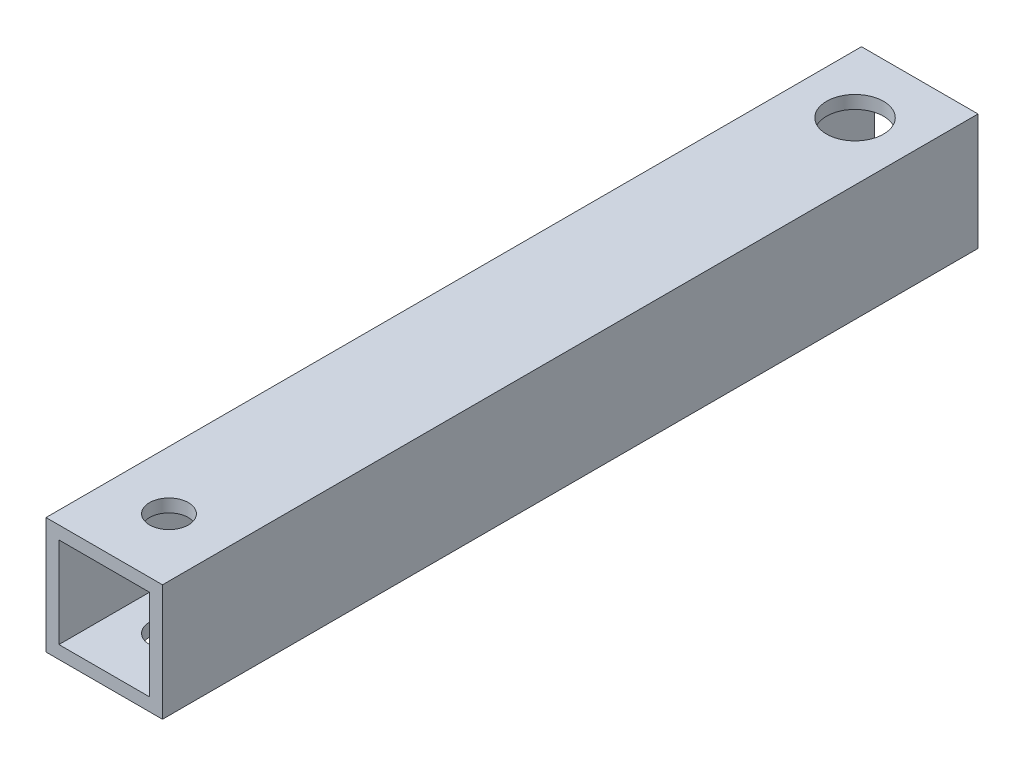
ISO-10303-21;
HEADER;
FILE_DESCRIPTION(('STEP AP214'),'2;1');
FILE_NAME('part.step','',(''),(''),'','','');
FILE_SCHEMA(('AUTOMOTIVE_DESIGN { 1 0 10303 214 1 1 1 1 }'));
ENDSEC;
DATA;
#1=APPLICATION_CONTEXT('core data for automotive mechanical design processes');
#2=APPLICATION_PROTOCOL_DEFINITION('international standard','automotive_design',2000,#1);
#3=PRODUCT_CONTEXT('',#1,'mechanical');
#4=PRODUCT('Part','Part','',(#3));
#5=PRODUCT_RELATED_PRODUCT_CATEGORY('part','',(#4));
#6=PRODUCT_DEFINITION_FORMATION('','',#4);
#7=PRODUCT_DEFINITION_CONTEXT('part definition',#1,'design');
#8=PRODUCT_DEFINITION('design','',#6,#7);
#9=PRODUCT_DEFINITION_SHAPE('','',#8);
#10=(LENGTH_UNIT() NAMED_UNIT(*) SI_UNIT(.MILLI.,.METRE.));
#11=(NAMED_UNIT(*) PLANE_ANGLE_UNIT() SI_UNIT($,.RADIAN.));
#12=(NAMED_UNIT(*) SI_UNIT($,.STERADIAN.) SOLID_ANGLE_UNIT());
#13=UNCERTAINTY_MEASURE_WITH_UNIT(LENGTH_MEASURE(1.E-05),#10,'distance_accuracy_value','');
#14=(GEOMETRIC_REPRESENTATION_CONTEXT(3) GLOBAL_UNCERTAINTY_ASSIGNED_CONTEXT((#13)) GLOBAL_UNIT_ASSIGNED_CONTEXT((#10,
#11,#12)) REPRESENTATION_CONTEXT('',''));
#15=CARTESIAN_POINT('',(0.,0.,0.));
#16=DIRECTION('',(0.,0.,1.));
#17=DIRECTION('',(1.,0.,0.));
#18=AXIS2_PLACEMENT_3D('',#15,#16,#17);
#19=CARTESIAN_POINT('',(4.5,4.5,63.));
#20=DIRECTION('',(-1.,0.,0.));
#21=DIRECTION('',(0.,0.,1.));
#22=AXIS2_PLACEMENT_3D('',#19,#20,#21);
#23=PLANE('',#22);
#24=DIRECTION('',(0.,1.,0.));
#25=VECTOR('',#24,1.);
#26=CARTESIAN_POINT('',(4.5,4.5,0.));
#27=LINE('',#26,#25);
#28=CARTESIAN_POINT('',(4.5,-4.5,0.));
#29=VERTEX_POINT('',#28);
#30=CARTESIAN_POINT('',(4.5,4.5,0.));
#31=VERTEX_POINT('',#30);
#32=EDGE_CURVE('E137',#29,#31,#27,.T.);
#33=ORIENTED_EDGE('',*,*,#32,.T.);
#34=DIRECTION('',(0.,0.,-1.));
#35=VECTOR('',#34,1.);
#36=CARTESIAN_POINT('',(4.5,4.5,63.));
#37=LINE('',#36,#35);
#38=CARTESIAN_POINT('',(4.5,4.5,63.));
#39=VERTEX_POINT('',#38);
#40=EDGE_CURVE('E179',#39,#31,#37,.T.);
#41=ORIENTED_EDGE('',*,*,#40,.F.);
#42=DIRECTION('',(0.,1.,0.));
#43=VECTOR('',#42,1.);
#44=CARTESIAN_POINT('',(4.5,4.5,63.));
#45=LINE('',#44,#43);
#46=CARTESIAN_POINT('',(4.5,-4.5,63.));
#47=VERTEX_POINT('',#46);
#48=EDGE_CURVE('E142',#47,#39,#45,.T.);
#49=ORIENTED_EDGE('',*,*,#48,.F.);
#50=DIRECTION('',(0.,0.,-1.));
#51=VECTOR('',#50,1.);
#52=CARTESIAN_POINT('',(4.5,-4.5,63.));
#53=LINE('',#52,#51);
#54=EDGE_CURVE('E156',#47,#29,#53,.T.);
#55=ORIENTED_EDGE('',*,*,#54,.T.);
#56=EDGE_LOOP('',(#33,#41,#49,#55));
#57=FACE_BOUND('',#56,.T.);
#58=ADVANCED_FACE('F39',(#57),#23,.F.);
#59=CARTESIAN_POINT('',(-4.5,4.5,63.));
#60=DIRECTION('',(0.,-1.,0.));
#61=DIRECTION('',(0.,0.,-1.));
#62=AXIS2_PLACEMENT_3D('',#59,#60,#61);
#63=PLANE('',#62);
#64=CARTESIAN_POINT('',(0.,4.5,5.));
#65=DIRECTION('',(0.,1.,0.));
#66=DIRECTION('',(0.,0.,1.));
#67=AXIS2_PLACEMENT_3D('',#64,#65,#66);
#68=CIRCLE('',#67,2.2);
#69=CARTESIAN_POINT('',(0.,4.5,7.2));
#70=VERTEX_POINT('',#69);
#71=EDGE_CURVE('E194',#70,#70,#68,.T.);
#72=ORIENTED_EDGE('',*,*,#71,.F.);
#73=EDGE_LOOP('',(#72));
#74=FACE_BOUND('',#73,.T.);
#75=CARTESIAN_POINT('',(0.,4.5,58.));
#76=DIRECTION('',(0.,1.,0.));
#77=DIRECTION('',(0.,0.,1.));
#78=AXIS2_PLACEMENT_3D('',#75,#76,#77);
#79=CIRCLE('',#78,1.5);
#80=CARTESIAN_POINT('',(0.,4.5,59.5));
#81=VERTEX_POINT('',#80);
#82=EDGE_CURVE('E203',#81,#81,#79,.T.);
#83=ORIENTED_EDGE('',*,*,#82,.F.);
#84=EDGE_LOOP('',(#83));
#85=FACE_BOUND('',#84,.T.);
#86=DIRECTION('',(-1.,0.,0.));
#87=VECTOR('',#86,1.);
#88=CARTESIAN_POINT('',(-4.5,4.5,0.));
#89=LINE('',#88,#87);
#90=CARTESIAN_POINT('',(-4.5,4.5,0.));
#91=VERTEX_POINT('',#90);
#92=EDGE_CURVE('E160',#31,#91,#89,.T.);
#93=ORIENTED_EDGE('',*,*,#92,.T.);
#94=DIRECTION('',(0.,0.,-1.));
#95=VECTOR('',#94,1.);
#96=CARTESIAN_POINT('',(-4.5,4.5,63.));
#97=LINE('',#96,#95);
#98=CARTESIAN_POINT('',(-4.5,4.5,63.));
#99=VERTEX_POINT('',#98);
#100=EDGE_CURVE('E175',#99,#91,#97,.T.);
#101=ORIENTED_EDGE('',*,*,#100,.F.);
#102=DIRECTION('',(-1.,0.,0.));
#103=VECTOR('',#102,1.);
#104=CARTESIAN_POINT('',(-4.5,4.5,63.));
#105=LINE('',#104,#103);
#106=EDGE_CURVE('E146',#39,#99,#105,.T.);
#107=ORIENTED_EDGE('',*,*,#106,.F.);
#108=ORIENTED_EDGE('',*,*,#40,.T.);
#109=EDGE_LOOP('',(#93,#101,#107,#108));
#110=FACE_BOUND('',#109,.T.);
#111=ADVANCED_FACE('F243',(#74,#85,#110),#63,.F.);
#112=CARTESIAN_POINT('',(-4.5,4.5,63.));
#113=DIRECTION('',(1.,0.,0.));
#114=DIRECTION('',(0.,0.,-1.));
#115=AXIS2_PLACEMENT_3D('',#112,#113,#114);
#116=PLANE('',#115);
#117=DIRECTION('',(0.,-1.,0.));
#118=VECTOR('',#117,1.);
#119=CARTESIAN_POINT('',(-4.5,4.5,0.));
#120=LINE('',#119,#118);
#121=CARTESIAN_POINT('',(-4.5,-4.5,0.));
#122=VERTEX_POINT('',#121);
#123=EDGE_CURVE('E163',#91,#122,#120,.T.);
#124=ORIENTED_EDGE('',*,*,#123,.T.);
#125=DIRECTION('',(0.,0.,-1.));
#126=VECTOR('',#125,1.);
#127=CARTESIAN_POINT('',(-4.5,-4.5,63.));
#128=LINE('',#127,#126);
#129=CARTESIAN_POINT('',(-4.5,-4.5,63.));
#130=VERTEX_POINT('',#129);
#131=EDGE_CURVE('E171',#130,#122,#128,.T.);
#132=ORIENTED_EDGE('',*,*,#131,.F.);
#133=DIRECTION('',(0.,-1.,0.));
#134=VECTOR('',#133,1.);
#135=CARTESIAN_POINT('',(-4.5,4.5,63.));
#136=LINE('',#135,#134);
#137=EDGE_CURVE('E150',#99,#130,#136,.T.);
#138=ORIENTED_EDGE('',*,*,#137,.F.);
#139=ORIENTED_EDGE('',*,*,#100,.T.);
#140=EDGE_LOOP('',(#124,#132,#138,#139));
#141=FACE_BOUND('',#140,.T.);
#142=ADVANCED_FACE('F248',(#141),#116,.F.);
#143=CARTESIAN_POINT('',(-4.5,-4.5,63.));
#144=DIRECTION('',(0.,1.,0.));
#145=DIRECTION('',(0.,0.,1.));
#146=AXIS2_PLACEMENT_3D('',#143,#144,#145);
#147=PLANE('',#146);
#148=CARTESIAN_POINT('',(0.,-4.5,5.));
#149=DIRECTION('',(0.,1.,0.));
#150=DIRECTION('',(0.,0.,1.));
#151=AXIS2_PLACEMENT_3D('',#148,#149,#150);
#152=CIRCLE('',#151,2.2);
#153=CARTESIAN_POINT('',(0.,-4.5,7.2));
#154=VERTEX_POINT('',#153);
#155=EDGE_CURVE('E218',#154,#154,#152,.T.);
#156=ORIENTED_EDGE('',*,*,#155,.T.);
#157=EDGE_LOOP('',(#156));
#158=FACE_BOUND('',#157,.T.);
#159=CARTESIAN_POINT('',(0.,-4.5,58.));
#160=DIRECTION('',(0.,1.,0.));
#161=DIRECTION('',(0.,0.,1.));
#162=AXIS2_PLACEMENT_3D('',#159,#160,#161);
#163=CIRCLE('',#162,1.5);
#164=CARTESIAN_POINT('',(0.,-4.5,59.5));
#165=VERTEX_POINT('',#164);
#166=EDGE_CURVE('E200',#165,#165,#163,.T.);
#167=ORIENTED_EDGE('',*,*,#166,.T.);
#168=EDGE_LOOP('',(#167));
#169=FACE_BOUND('',#168,.T.);
#170=DIRECTION('',(1.,0.,0.));
#171=VECTOR('',#170,1.);
#172=CARTESIAN_POINT('',(-4.5,-4.5,0.));
#173=LINE('',#172,#171);
#174=EDGE_CURVE('E147',#122,#29,#173,.T.);
#175=ORIENTED_EDGE('',*,*,#174,.T.);
#176=ORIENTED_EDGE('',*,*,#54,.F.);
#177=DIRECTION('',(1.,0.,0.));
#178=VECTOR('',#177,1.);
#179=CARTESIAN_POINT('',(-4.5,-4.5,63.));
#180=LINE('',#179,#178);
#181=EDGE_CURVE('E153',#130,#47,#180,.T.);
#182=ORIENTED_EDGE('',*,*,#181,.F.);
#183=ORIENTED_EDGE('',*,*,#131,.T.);
#184=EDGE_LOOP('',(#175,#176,#182,#183));
#185=FACE_BOUND('',#184,.T.);
#186=ADVANCED_FACE('F264',(#158,#169,#185),#147,.F.);
#187=CARTESIAN_POINT('',(0.,0.,63.));
#188=DIRECTION('',(0.,0.,1.));
#189=DIRECTION('',(1.,0.,0.));
#190=AXIS2_PLACEMENT_3D('',#187,#188,#189);
#191=PLANE('',#190);
#192=DIRECTION('',(0.,1.,0.));
#193=VECTOR('',#192,1.);
#194=CARTESIAN_POINT('',(3.5,3.5,63.));
#195=LINE('',#194,#193);
#196=CARTESIAN_POINT('',(3.5,-3.5,63.));
#197=VERTEX_POINT('',#196);
#198=CARTESIAN_POINT('',(3.5,3.5,63.));
#199=VERTEX_POINT('',#198);
#200=EDGE_CURVE('E56',#197,#199,#195,.T.);
#201=ORIENTED_EDGE('',*,*,#200,.F.);
#202=DIRECTION('',(1.,0.,0.));
#203=VECTOR('',#202,1.);
#204=CARTESIAN_POINT('',(-3.5,-3.5,63.));
#205=LINE('',#204,#203);
#206=CARTESIAN_POINT('',(-3.5,-3.5,63.));
#207=VERTEX_POINT('',#206);
#208=EDGE_CURVE('E127',#207,#197,#205,.T.);
#209=ORIENTED_EDGE('',*,*,#208,.F.);
#210=DIRECTION('',(0.,-1.,0.));
#211=VECTOR('',#210,1.);
#212=CARTESIAN_POINT('',(-3.5,3.5,63.));
#213=LINE('',#212,#211);
#214=CARTESIAN_POINT('',(-3.5,3.5,63.));
#215=VERTEX_POINT('',#214);
#216=EDGE_CURVE('E109',#215,#207,#213,.T.);
#217=ORIENTED_EDGE('',*,*,#216,.F.);
#218=DIRECTION('',(-1.,0.,0.));
#219=VECTOR('',#218,1.);
#220=CARTESIAN_POINT('',(-3.5,3.5,63.));
#221=LINE('',#220,#219);
#222=EDGE_CURVE('E119',#199,#215,#221,.T.);
#223=ORIENTED_EDGE('',*,*,#222,.F.);
#224=EDGE_LOOP('',(#201,#209,#217,#223));
#225=FACE_BOUND('',#224,.T.);
#226=ORIENTED_EDGE('',*,*,#48,.T.);
#227=ORIENTED_EDGE('',*,*,#106,.T.);
#228=ORIENTED_EDGE('',*,*,#137,.T.);
#229=ORIENTED_EDGE('',*,*,#181,.T.);
#230=EDGE_LOOP('',(#226,#227,#228,#229));
#231=FACE_BOUND('',#230,.T.);
#232=ADVANCED_FACE('F124',(#225,#231),#191,.T.);
#233=CARTESIAN_POINT('',(0.,0.,0.));
#234=DIRECTION('',(0.,0.,1.));
#235=DIRECTION('',(1.,0.,0.));
#236=AXIS2_PLACEMENT_3D('',#233,#234,#235);
#237=PLANE('',#236);
#238=DIRECTION('',(1.,0.,0.));
#239=VECTOR('',#238,1.);
#240=CARTESIAN_POINT('',(0.,-3.5,0.));
#241=LINE('',#240,#239);
#242=CARTESIAN_POINT('',(-3.5,-3.5,0.));
#243=VERTEX_POINT('',#242);
#244=CARTESIAN_POINT('',(3.5,-3.5,0.));
#245=VERTEX_POINT('',#244);
#246=EDGE_CURVE('E48',#243,#245,#241,.T.);
#247=ORIENTED_EDGE('',*,*,#246,.T.);
#248=DIRECTION('',(0.,1.,0.));
#249=VECTOR('',#248,1.);
#250=CARTESIAN_POINT('',(3.5,0.,0.));
#251=LINE('',#250,#249);
#252=CARTESIAN_POINT('',(3.5,3.5,0.));
#253=VERTEX_POINT('',#252);
#254=EDGE_CURVE('E11',#245,#253,#251,.T.);
#255=ORIENTED_EDGE('',*,*,#254,.T.);
#256=DIRECTION('',(-1.,0.,0.));
#257=VECTOR('',#256,1.);
#258=CARTESIAN_POINT('',(0.,3.5,0.));
#259=LINE('',#258,#257);
#260=CARTESIAN_POINT('',(-3.5,3.5,0.));
#261=VERTEX_POINT('',#260);
#262=EDGE_CURVE('E183',#253,#261,#259,.T.);
#263=ORIENTED_EDGE('',*,*,#262,.T.);
#264=DIRECTION('',(0.,-1.,0.));
#265=VECTOR('',#264,1.);
#266=CARTESIAN_POINT('',(-3.5,0.,0.));
#267=LINE('',#266,#265);
#268=EDGE_CURVE('E112',#261,#243,#267,.T.);
#269=ORIENTED_EDGE('',*,*,#268,.T.);
#270=EDGE_LOOP('',(#247,#255,#263,#269));
#271=FACE_BOUND('',#270,.T.);
#272=ORIENTED_EDGE('',*,*,#32,.F.);
#273=ORIENTED_EDGE('',*,*,#174,.F.);
#274=ORIENTED_EDGE('',*,*,#123,.F.);
#275=ORIENTED_EDGE('',*,*,#92,.F.);
#276=EDGE_LOOP('',(#272,#273,#274,#275));
#277=FACE_BOUND('',#276,.T.);
#278=ADVANCED_FACE('F256',(#271,#277),#237,.F.);
#279=CARTESIAN_POINT('',(3.5,3.5,-20.));
#280=DIRECTION('',(1.,0.,0.));
#281=DIRECTION('',(0.,1.,0.));
#282=AXIS2_PLACEMENT_3D('',#279,#280,#281);
#283=PLANE('',#282);
#284=DIRECTION('',(0.,0.,1.));
#285=VECTOR('',#284,1.);
#286=CARTESIAN_POINT('',(3.5,-3.5,-20.));
#287=LINE('',#286,#285);
#288=EDGE_CURVE('E134',#245,#197,#287,.T.);
#289=ORIENTED_EDGE('',*,*,#288,.T.);
#290=ORIENTED_EDGE('',*,*,#200,.T.);
#291=DIRECTION('',(0.,0.,1.));
#292=VECTOR('',#291,1.);
#293=CARTESIAN_POINT('',(3.5,3.5,-20.));
#294=LINE('',#293,#292);
#295=EDGE_CURVE('E116',#253,#199,#294,.T.);
#296=ORIENTED_EDGE('',*,*,#295,.F.);
#297=ORIENTED_EDGE('',*,*,#254,.F.);
#298=EDGE_LOOP('',(#289,#290,#296,#297));
#299=FACE_BOUND('',#298,.T.);
#300=ADVANCED_FACE('F276',(#299),#283,.F.);
#301=CARTESIAN_POINT('',(-3.5,-3.5,-20.));
#302=DIRECTION('',(0.,-1.,0.));
#303=DIRECTION('',(0.,0.,-1.));
#304=AXIS2_PLACEMENT_3D('',#301,#302,#303);
#305=PLANE('',#304);
#306=CARTESIAN_POINT('',(0.,-3.5,5.));
#307=DIRECTION('',(0.,-1.,0.));
#308=DIRECTION('',(0.,0.,-1.));
#309=AXIS2_PLACEMENT_3D('',#306,#307,#308);
#310=CIRCLE('',#309,2.2);
#311=CARTESIAN_POINT('',(0.,-3.5,2.8));
#312=VERTEX_POINT('',#311);
#313=EDGE_CURVE('E214',#312,#312,#310,.T.);
#314=ORIENTED_EDGE('',*,*,#313,.T.);
#315=EDGE_LOOP('',(#314));
#316=FACE_BOUND('',#315,.T.);
#317=CARTESIAN_POINT('',(0.,-3.5,58.));
#318=DIRECTION('',(0.,-1.,0.));
#319=DIRECTION('',(0.,0.,-1.));
#320=AXIS2_PLACEMENT_3D('',#317,#318,#319);
#321=CIRCLE('',#320,1.5);
#322=CARTESIAN_POINT('',(0.,-3.5,56.5));
#323=VERTEX_POINT('',#322);
#324=EDGE_CURVE('E193',#323,#323,#321,.T.);
#325=ORIENTED_EDGE('',*,*,#324,.T.);
#326=EDGE_LOOP('',(#325));
#327=FACE_BOUND('',#326,.T.);
#328=DIRECTION('',(0.,0.,1.));
#329=VECTOR('',#328,1.);
#330=CARTESIAN_POINT('',(-3.5,-3.5,-20.));
#331=LINE('',#330,#329);
#332=EDGE_CURVE('E115',#243,#207,#331,.T.);
#333=ORIENTED_EDGE('',*,*,#332,.T.);
#334=ORIENTED_EDGE('',*,*,#208,.T.);
#335=ORIENTED_EDGE('',*,*,#288,.F.);
#336=ORIENTED_EDGE('',*,*,#246,.F.);
#337=EDGE_LOOP('',(#333,#334,#335,#336));
#338=FACE_BOUND('',#337,.T.);
#339=ADVANCED_FACE('F282',(#316,#327,#338),#305,.F.);
#340=CARTESIAN_POINT('',(-3.5,3.5,-20.));
#341=DIRECTION('',(-1.,0.,0.));
#342=DIRECTION('',(0.,-1.,0.));
#343=AXIS2_PLACEMENT_3D('',#340,#341,#342);
#344=PLANE('',#343);
#345=DIRECTION('',(0.,0.,1.));
#346=VECTOR('',#345,1.);
#347=CARTESIAN_POINT('',(-3.5,3.5,-20.));
#348=LINE('',#347,#346);
#349=EDGE_CURVE('E64',#261,#215,#348,.T.);
#350=ORIENTED_EDGE('',*,*,#349,.T.);
#351=ORIENTED_EDGE('',*,*,#216,.T.);
#352=ORIENTED_EDGE('',*,*,#332,.F.);
#353=ORIENTED_EDGE('',*,*,#268,.F.);
#354=EDGE_LOOP('',(#350,#351,#352,#353));
#355=FACE_BOUND('',#354,.T.);
#356=ADVANCED_FACE('F106',(#355),#344,.F.);
#357=CARTESIAN_POINT('',(-3.5,3.5,-20.));
#358=DIRECTION('',(0.,1.,0.));
#359=DIRECTION('',(0.,0.,1.));
#360=AXIS2_PLACEMENT_3D('',#357,#358,#359);
#361=PLANE('',#360);
#362=CARTESIAN_POINT('',(0.,3.5,5.));
#363=DIRECTION('',(0.,1.,0.));
#364=DIRECTION('',(0.,0.,1.));
#365=AXIS2_PLACEMENT_3D('',#362,#363,#364);
#366=CIRCLE('',#365,2.2);
#367=CARTESIAN_POINT('',(0.,3.5,7.2));
#368=VERTEX_POINT('',#367);
#369=EDGE_CURVE('E42',#368,#368,#366,.T.);
#370=ORIENTED_EDGE('',*,*,#369,.T.);
#371=EDGE_LOOP('',(#370));
#372=FACE_BOUND('',#371,.T.);
#373=CARTESIAN_POINT('',(0.,3.5,58.));
#374=DIRECTION('',(0.,1.,0.));
#375=DIRECTION('',(0.,0.,1.));
#376=AXIS2_PLACEMENT_3D('',#373,#374,#375);
#377=CIRCLE('',#376,1.5);
#378=CARTESIAN_POINT('',(0.,3.5,59.5));
#379=VERTEX_POINT('',#378);
#380=EDGE_CURVE('E190',#379,#379,#377,.T.);
#381=ORIENTED_EDGE('',*,*,#380,.T.);
#382=EDGE_LOOP('',(#381));
#383=FACE_BOUND('',#382,.T.);
#384=ORIENTED_EDGE('',*,*,#295,.T.);
#385=ORIENTED_EDGE('',*,*,#222,.T.);
#386=ORIENTED_EDGE('',*,*,#349,.F.);
#387=ORIENTED_EDGE('',*,*,#262,.F.);
#388=EDGE_LOOP('',(#384,#385,#386,#387));
#389=FACE_BOUND('',#388,.T.);
#390=ADVANCED_FACE('F120',(#372,#383,#389),#361,.F.);
#391=CARTESIAN_POINT('',(0.,-88.5,58.));
#392=DIRECTION('',(0.,1.,0.));
#393=DIRECTION('',(0.,0.,1.));
#394=AXIS2_PLACEMENT_3D('',#391,#392,#393);
#395=CYLINDRICAL_SURFACE('',#394,1.5);
#396=ORIENTED_EDGE('',*,*,#82,.T.);
#397=EDGE_LOOP('',(#396));
#398=FACE_BOUND('',#397,.T.);
#399=ORIENTED_EDGE('',*,*,#380,.F.);
#400=EDGE_LOOP('',(#399));
#401=FACE_BOUND('',#400,.T.);
#402=ADVANCED_FACE('F230',(#398,#401),#395,.F.);
#403=CARTESIAN_POINT('',(0.,-88.5,5.));
#404=DIRECTION('',(0.,1.,0.));
#405=DIRECTION('',(0.,0.,1.));
#406=AXIS2_PLACEMENT_3D('',#403,#404,#405);
#407=CYLINDRICAL_SURFACE('',#406,2.2);
#408=ORIENTED_EDGE('',*,*,#71,.T.);
#409=EDGE_LOOP('',(#408));
#410=FACE_BOUND('',#409,.T.);
#411=ORIENTED_EDGE('',*,*,#369,.F.);
#412=EDGE_LOOP('',(#411));
#413=FACE_BOUND('',#412,.T.);
#414=ADVANCED_FACE('F227',(#410,#413),#407,.F.);
#415=ORIENTED_EDGE('',*,*,#324,.F.);
#416=EDGE_LOOP('',(#415));
#417=FACE_BOUND('',#416,.T.);
#418=ORIENTED_EDGE('',*,*,#166,.F.);
#419=EDGE_LOOP('',(#418));
#420=FACE_BOUND('',#419,.T.);
#421=ADVANCED_FACE('F229',(#417,#420),#395,.F.);
#422=ORIENTED_EDGE('',*,*,#313,.F.);
#423=EDGE_LOOP('',(#422));
#424=FACE_BOUND('',#423,.T.);
#425=ORIENTED_EDGE('',*,*,#155,.F.);
#426=EDGE_LOOP('',(#425));
#427=FACE_BOUND('',#426,.T.);
#428=ADVANCED_FACE('F232',(#424,#427),#407,.F.);
#429=CLOSED_SHELL('',(#58,#111,#142,#186,#232,#278,#300,#339,#356,#390,#402,#414,#421,#428));
#430=MANIFOLD_SOLID_BREP('B2',#429);
#431=ADVANCED_BREP_SHAPE_REPRESENTATION('',(#18,#430),#14);
#432=SHAPE_DEFINITION_REPRESENTATION(#9,#431);
ENDSEC;
END-ISO-10303-21;
